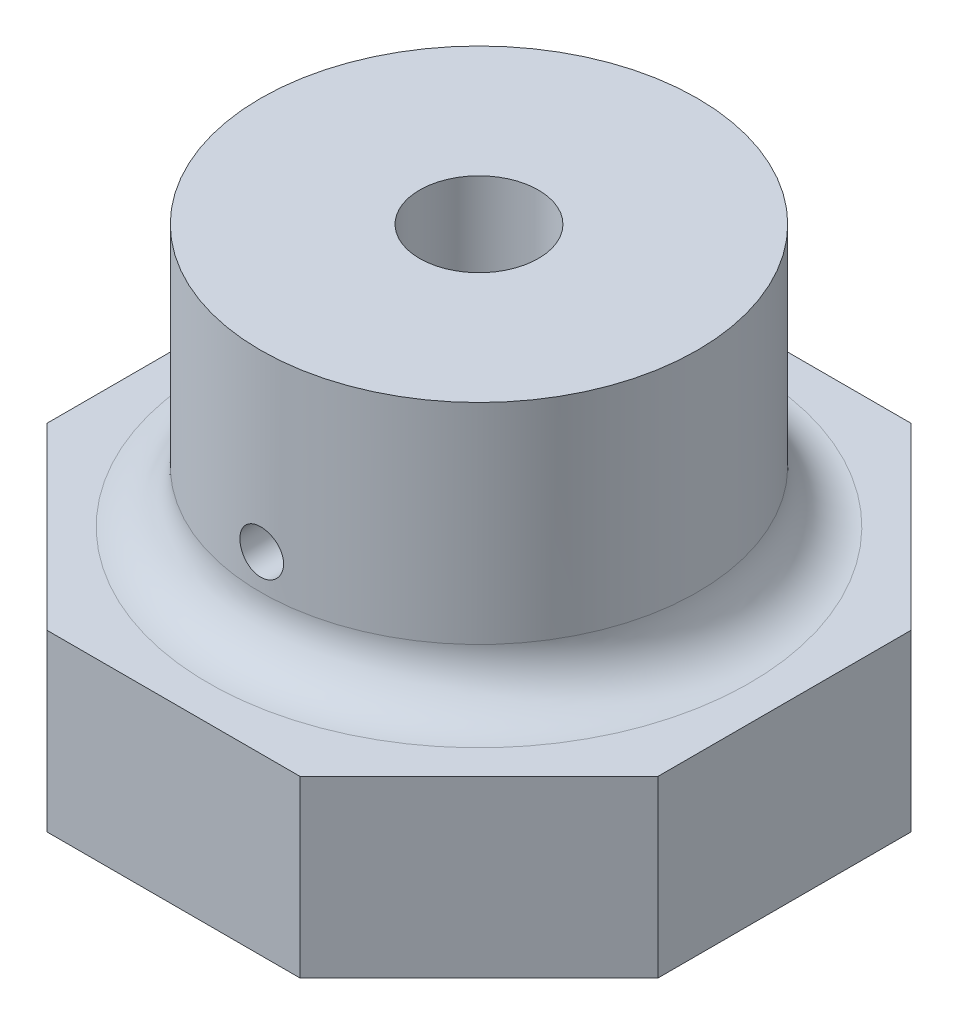
ISO-10303-21;
HEADER;
FILE_DESCRIPTION(('STEP AP214'),'2;1');
FILE_NAME('part.step','',(''),(''),'','','');
FILE_SCHEMA(('AUTOMOTIVE_DESIGN { 1 0 10303 214 1 1 1 1 }'));
ENDSEC;
DATA;
#1=APPLICATION_CONTEXT('core data for automotive mechanical design processes');
#2=APPLICATION_PROTOCOL_DEFINITION('international standard','automotive_design',2000,#1);
#3=PRODUCT_CONTEXT('',#1,'mechanical');
#4=PRODUCT('Part','Part','',(#3));
#5=PRODUCT_RELATED_PRODUCT_CATEGORY('part','',(#4));
#6=PRODUCT_DEFINITION_FORMATION('','',#4);
#7=PRODUCT_DEFINITION_CONTEXT('part definition',#1,'design');
#8=PRODUCT_DEFINITION('design','',#6,#7);
#9=PRODUCT_DEFINITION_SHAPE('','',#8);
#10=(LENGTH_UNIT() NAMED_UNIT(*) SI_UNIT(.MILLI.,.METRE.));
#11=(NAMED_UNIT(*) PLANE_ANGLE_UNIT() SI_UNIT($,.RADIAN.));
#12=(NAMED_UNIT(*) SI_UNIT($,.STERADIAN.) SOLID_ANGLE_UNIT());
#13=UNCERTAINTY_MEASURE_WITH_UNIT(LENGTH_MEASURE(1.E-05),#10,'distance_accuracy_value','');
#14=(GEOMETRIC_REPRESENTATION_CONTEXT(3) GLOBAL_UNCERTAINTY_ASSIGNED_CONTEXT((#13)) GLOBAL_UNIT_ASSIGNED_CONTEXT((#10,
#11,#12)) REPRESENTATION_CONTEXT('',''));
#15=CARTESIAN_POINT('',(0.,0.,0.));
#16=DIRECTION('',(0.,0.,1.));
#17=DIRECTION('',(1.,0.,0.));
#18=AXIS2_PLACEMENT_3D('',#15,#16,#17);
#19=CARTESIAN_POINT('',(0.,25.,0.));
#20=DIRECTION('',(0.,-1.,0.));
#21=DIRECTION('',(0.,0.,-1.));
#22=AXIS2_PLACEMENT_3D('',#19,#20,#21);
#23=CYLINDRICAL_SURFACE('',#22,12.5);
#24=CARTESIAN_POINT('',(0.,13.,0.));
#25=DIRECTION('',(0.,-1.,0.));
#26=DIRECTION('',(0.,0.,-1.));
#27=AXIS2_PLACEMENT_3D('',#24,#25,#26);
#28=CIRCLE('',#27,12.5);
#29=CARTESIAN_POINT('',(0.,13.,-12.5));
#30=VERTEX_POINT('',#29);
#31=EDGE_CURVE('E11',#30,#30,#28,.F.);
#32=ORIENTED_EDGE('',*,*,#31,.T.);
#33=EDGE_LOOP('',(#32));
#34=FACE_BOUND('',#33,.T.);
#35=CARTESIAN_POINT('',(0.,13.75,12.5));
#36=CARTESIAN_POINT('',(0.0700254422394466,13.7500030323755,12.4999991940096));
#37=CARTESIAN_POINT('',(0.140097181459716,13.7559040861206,12.4994053199526));
#38=CARTESIAN_POINT('',(0.278297998121046,13.779355462863,12.4970933449342));
#39=CARTESIAN_POINT('',(0.346424848961035,13.7969186200307,12.4953740054253));
#40=CARTESIAN_POINT('',(0.478714594316768,13.8431778007473,12.4910051820384));
#41=CARTESIAN_POINT('',(0.542879855768636,13.8718671006481,12.4883562600089));
#42=CARTESIAN_POINT('',(0.665470201200507,13.9395511349146,12.4824244674288));
#43=CARTESIAN_POINT('',(0.723896423473845,13.9785438200002,12.4791417229766));
#44=CARTESIAN_POINT('',(0.833574438342602,14.0658783720778,12.4722968042665));
#45=CARTESIAN_POINT('',(0.884802681043615,14.1142497492525,12.4687337696733));
#46=CARTESIAN_POINT('',(0.97842815178873,14.2189056678288,12.4617369613283));
#47=CARTESIAN_POINT('',(1.02082497135332,14.275190575053,12.4583031935615));
#48=CARTESIAN_POINT('',(1.09566746305452,14.3942231646045,12.4519448944098));
#49=CARTESIAN_POINT('',(1.1280918318186,14.4569843051186,12.4490214588863));
#50=CARTESIAN_POINT('',(1.18193298092845,14.5870944823812,12.4440254693316));
#51=CARTESIAN_POINT('',(1.20335003323911,14.6544434057299,12.4419528942778));
#52=CARTESIAN_POINT('',(1.23449880200237,14.7915772510825,12.4389010509122));
#53=CARTESIAN_POINT('',(1.24426956625474,14.8613532210653,12.4379181299762));
#54=CARTESIAN_POINT('',(1.2519691064192,15.0015610792447,12.4371455382566));
#55=CARTESIAN_POINT('',(1.2498981935885,15.0719929501526,12.4373558361093));
#56=CARTESIAN_POINT('',(1.23400535031585,15.2112441371166,12.4389425862367));
#57=CARTESIAN_POINT('',(1.22022605515569,15.2800683741609,12.4403148073831));
#58=CARTESIAN_POINT('',(1.18137393018823,15.4144224540014,12.4440641785927));
#59=CARTESIAN_POINT('',(1.15630094781968,15.4799522522813,12.4464413422311));
#60=CARTESIAN_POINT('',(1.09552611735188,15.6059919841236,12.4519376181509));
#61=CARTESIAN_POINT('',(1.05980535339997,15.6664927368616,12.455058048852));
#62=CARTESIAN_POINT('',(0.978762534191533,15.7806565186399,12.461688146661));
#63=CARTESIAN_POINT('',(0.933440197920632,15.8343193474772,12.4651978251598));
#64=CARTESIAN_POINT('',(0.834242640515087,15.9335317424863,12.4722298164124));
#65=CARTESIAN_POINT('',(0.780330598564205,15.979044502351,12.4757521166625));
#66=CARTESIAN_POINT('',(0.665611852171391,16.060379541138,12.4823978634815));
#67=CARTESIAN_POINT('',(0.604805139999502,16.0962018091956,12.4855213096032));
#68=CARTESIAN_POINT('',(0.477997632115458,16.1571375253878,12.4910184458387));
#69=CARTESIAN_POINT('',(0.41199593298738,16.1822491060226,12.4933920051846));
#70=CARTESIAN_POINT('',(0.276684021662415,16.2210236458897,12.4971205930176));
#71=CARTESIAN_POINT('',(0.207373908470751,16.2346869474883,12.4984756519633));
#72=CARTESIAN_POINT('',(0.0677313738648797,16.2501303846685,12.5000106458539));
#73=CARTESIAN_POINT('',(-0.0025953776318649,16.2519613103156,12.5001956033467));
#74=CARTESIAN_POINT('',(-0.142554741644625,16.243821421189,12.49938302196));
#75=CARTESIAN_POINT('',(-0.212187363525588,16.2338507658559,12.4983854990559));
#76=CARTESIAN_POINT('',(-0.348635258543343,16.202432880723,12.4953232692399));
#77=CARTESIAN_POINT('',(-0.415456061215023,16.1810094319025,12.4932607739755));
#78=CARTESIAN_POINT('',(-0.544555401729726,16.1273185324534,12.4882999857576));
#79=CARTESIAN_POINT('',(-0.606833837696396,16.0950508387008,12.4854016740657));
#80=CARTESIAN_POINT('',(-0.725310225215178,16.0204614516701,12.4790809416303));
#81=CARTESIAN_POINT('',(-0.781487074686146,15.9781063888427,12.475656795043));
#82=CARTESIAN_POINT('',(-0.885952029139847,15.8845924153238,12.468674160869));
#83=CARTESIAN_POINT('',(-0.934239936061471,15.8334332836621,12.4651156699121));
#84=CARTESIAN_POINT('',(-1.02173263735893,15.7235417816762,12.4582503017594));
#85=CARTESIAN_POINT('',(-1.06090409834943,15.6647828043217,12.4549443767372));
#86=CARTESIAN_POINT('',(-1.12882282342978,15.5414907998166,12.4489729057611));
#87=CARTESIAN_POINT('',(-1.15757023006735,15.4769578516395,12.4463073510505));
#88=CARTESIAN_POINT('',(-1.20376901085559,15.3440640756678,12.4419243454256));
#89=CARTESIAN_POINT('',(-1.22124021851483,15.2757101998861,12.4402052306224));
#90=CARTESIAN_POINT('',(-1.24445500891183,15.137021002549,12.437904566036));
#91=CARTESIAN_POINT('',(-1.2501989279994,15.0666857378804,12.4373229836273));
#92=CARTESIAN_POINT('',(-1.24979142308907,14.9263616395541,12.4373639138445));
#93=CARTESIAN_POINT('',(-1.24369236199139,14.8563726463965,12.4379811260876));
#94=CARTESIAN_POINT('',(-1.21988181620457,14.7184188535396,12.4403387986193));
#95=CARTESIAN_POINT('',(-1.2021703184527,14.6504540561175,12.4420792601715));
#96=CARTESIAN_POINT('',(-1.15565210787188,14.5184783136902,12.4464858532898));
#97=CARTESIAN_POINT('',(-1.12684693042614,14.4544668229628,12.4491518567545));
#98=CARTESIAN_POINT('',(-1.0589644436388,14.3321788854112,12.455109397992));
#99=CARTESIAN_POINT('',(-1.01988719181927,14.2739024064742,12.4584009322619));
#100=CARTESIAN_POINT('',(-0.932373195356664,14.1644704069101,12.4652560901212));
#101=CARTESIAN_POINT('',(-0.883897436112835,14.1133461545411,12.4688208090844));
#102=CARTESIAN_POINT('',(-0.779039624031386,14.0199347091254,12.4758106841098));
#103=CARTESIAN_POINT('',(-0.722655680135321,13.9776496358035,12.4792358065372));
#104=CARTESIAN_POINT('',(-0.603426792701611,13.9030331826817,12.4855695258645));
#105=CARTESIAN_POINT('',(-0.540565936683454,13.8707271363185,12.4884768003352));
#106=CARTESIAN_POINT('',(-0.410322848875688,13.8171719714702,12.4934328656237));
#107=CARTESIAN_POINT('',(-0.342945812282012,13.7959103863081,12.4954826238707));
#108=CARTESIAN_POINT('',(-0.229322826757131,13.770349228644,12.4979776721717));
#109=CARTESIAN_POINT('',(-0.183803191055637,13.7627286946258,12.4987325086479));
#110=CARTESIAN_POINT('',(-0.0921957260216416,13.7525530924228,12.4997439368848));
#111=CARTESIAN_POINT('',(-0.0461078990331975,13.7499980033477,12.5000005307003));
#112=CARTESIAN_POINT('',(0.,13.75,12.5));
#113=B_SPLINE_CURVE_WITH_KNOTS('',3,(#35,#36,#37,#38,#39,#40,#41,#42,#43,#44,#45,#46,#47,#48,
#49,#50,#51,#52,#53,#54,#55,#56,#57,#58,#59,#60,#61,#62,#63,#64,#65,#66,#67,#68,#69,#70,#71,#72,
#73,#74,#75,#76,#77,#78,#79,#80,#81,#82,#83,#84,#85,#86,#87,#88,#89,#90,#91,#92,#93,#94,#95,#96,
#97,#98,#99,#100,#101,#102,#103,#104,#105,#106,#107,#108,#109,#110,#111,#112),.UNSPECIFIED.,.T.,
.F.,(4,2,2,2,2,2,2,2,2,2,2,2,2,2,2,2,2,2,2,2,2,2,2,2,2,2,2,2,2,2,2,2,2,2,2,2,2,2,4),(0.,
0.209907957835592,0.420047303544358,0.630059857165252,0.840030671978478,1.05067321077868,
1.26132549025882,1.47242469340277,1.6835186805313,1.89390290056496,2.10428159069721,
2.31389746801388,2.52351617702042,2.73350951716119,2.94350900413907,3.15443417745258,
3.36535958724714,3.57632175866977,3.78727762094299,3.99732735759697,4.20737425648929,
4.41698669117881,4.62660382561833,4.83692425935873,5.04724997262787,5.25833304510748,
5.46941323094217,5.68012113241254,5.89082299049482,6.10059536617445,6.3103679778255,
6.520111567035,6.729853981737,6.94048646784566,7.15116940796197,7.36238288782803,
7.57335743494118,7.71157084040435,7.84978367586284),.UNSPECIFIED.);
#114=CARTESIAN_POINT('',(0.,13.75,12.5));
#115=VERTEX_POINT('',#114);
#116=EDGE_CURVE('E166',#115,#115,#113,.T.);
#117=ORIENTED_EDGE('',*,*,#116,.F.);
#118=EDGE_LOOP('',(#117));
#119=FACE_BOUND('',#118,.T.);
#120=CARTESIAN_POINT('',(0.,25.,0.));
#121=DIRECTION('',(0.,1.,0.));
#122=DIRECTION('',(0.,0.,1.));
#123=AXIS2_PLACEMENT_3D('',#120,#121,#122);
#124=CIRCLE('',#123,12.5);
#125=CARTESIAN_POINT('',(0.,25.,12.5));
#126=VERTEX_POINT('',#125);
#127=EDGE_CURVE('E197',#126,#126,#124,.T.);
#128=ORIENTED_EDGE('',*,*,#127,.F.);
#129=EDGE_LOOP('',(#128));
#130=FACE_BOUND('',#129,.T.);
#131=ADVANCED_FACE('F33',(#34,#119,#130),#23,.T.);
#132=CARTESIAN_POINT('',(0.,-5.,0.));
#133=DIRECTION('',(0.,1.,0.));
#134=DIRECTION('',(0.,0.,1.));
#135=AXIS2_PLACEMENT_3D('',#132,#133,#134);
#136=CYLINDRICAL_SURFACE('',#135,3.4);
#137=CARTESIAN_POINT('',(0.,13.75,3.4));
#138=CARTESIAN_POINT('',(-0.0677892171607673,13.7499980170119,3.40000146331654));
#139=CARTESIAN_POINT('',(-0.135564598361934,13.7555318387459,3.39795478455394));
#140=CARTESIAN_POINT('',(-0.26909502855135,13.7774354118605,3.38999413885064));
#141=CARTESIAN_POINT('',(-0.334850280169572,13.7938040727101,3.38408056111566));
#142=CARTESIAN_POINT('',(-0.462395745289847,13.8367236694127,3.36902233821897));
#143=CARTESIAN_POINT('',(-0.52419316940682,13.863255435735,3.3598837785199));
#144=CARTESIAN_POINT('',(-0.642456858558572,13.9256525911258,3.33928988061704));
#145=CARTESIAN_POINT('',(-0.698921749443891,13.9615203771133,3.32783394762203));
#146=CARTESIAN_POINT('',(-0.807236062786028,14.0431113036963,3.30326648127006));
#147=CARTESIAN_POINT('',(-0.858837279397979,14.0891500983692,3.29010936165044));
#148=CARTESIAN_POINT('',(-0.953784546892117,14.1891059845685,3.26385143452452));
#149=CARTESIAN_POINT('',(-0.997128211461575,14.2430253455331,3.25075064436247));
#150=CARTESIAN_POINT('',(-1.07587794830608,14.3596015519421,3.22556373470524));
#151=CARTESIAN_POINT('',(-1.1109385995811,14.4225045942777,3.21353174119785));
#152=CARTESIAN_POINT('',(-1.169873285278,14.5538269292873,3.1925510826781));
#153=CARTESIAN_POINT('',(-1.19375159057167,14.6222441042281,3.18360124084615));
#154=CARTESIAN_POINT('',(-1.22867274772655,14.7598006640153,3.17028423169877));
#155=CARTESIAN_POINT('',(-1.240187857077,14.8288033629552,3.16574912315888));
#156=CARTESIAN_POINT('',(-1.25153246307679,14.9678991963207,3.16128255395447));
#157=CARTESIAN_POINT('',(-1.25136654827011,15.037991891756,3.16134928559326));
#158=CARTESIAN_POINT('',(-1.23971593690306,15.1730139586237,3.16593361273821));
#159=CARTESIAN_POINT('',(-1.22887882487036,15.2380094389009,3.17019655489708));
#160=CARTESIAN_POINT('',(-1.19726140059541,15.3651850627672,3.1822709670128));
#161=CARTESIAN_POINT('',(-1.17647964980696,15.4273647976184,3.19008295034953));
#162=CARTESIAN_POINT('',(-1.12519507437492,15.5484912223078,3.20853358348492));
#163=CARTESIAN_POINT('',(-1.09451999071546,15.6073571090671,3.21922172021088));
#164=CARTESIAN_POINT('',(-1.02443943999763,15.7192969276157,3.24220311718025));
#165=CARTESIAN_POINT('',(-0.985031042794176,15.772368906529,3.2544969155751));
#166=CARTESIAN_POINT('',(-0.895612788060466,15.8748094687074,3.2802706130014));
#167=CARTESIAN_POINT('',(-0.845083649862122,15.9237194686581,3.2937759110097));
#168=CARTESIAN_POINT('',(-0.736382513755413,16.0125048916467,3.31976812924212));
#169=CARTESIAN_POINT('',(-0.678209432538006,16.0523790319249,3.33225490471266));
#170=CARTESIAN_POINT('',(-0.5547386381725,16.1224405003473,3.35503450804791));
#171=CARTESIAN_POINT('',(-0.489350681704928,16.1524806435267,3.36529328894331));
#172=CARTESIAN_POINT('',(-0.353978761405023,16.2009839206669,3.3822096165739));
#173=CARTESIAN_POINT('',(-0.283996770412044,16.2194519886152,3.38886869794702));
#174=CARTESIAN_POINT('',(-0.145287056221838,16.2434180981954,3.39756841138687));
#175=CARTESIAN_POINT('',(-0.0766797713938729,16.2495340410432,3.39982885071684));
#176=CARTESIAN_POINT('',(0.0606097533059029,16.2504143095227,3.40015216072335));
#177=CARTESIAN_POINT('',(0.129291974246831,16.2451810367229,3.39821591944508));
#178=CARTESIAN_POINT('',(0.262148070171438,16.2239849677789,3.39050858407269));
#179=CARTESIAN_POINT('',(0.326394930340766,16.2084222303544,3.38488056379091));
#180=CARTESIAN_POINT('',(0.451324217395486,16.1675308263642,3.37049899094654));
#181=CARTESIAN_POINT('',(0.512006179294813,16.1422008890625,3.36174503170277));
#182=CARTESIAN_POINT('',(0.630048307528177,16.0816955074235,3.34166563948511));
#183=CARTESIAN_POINT('',(0.687261597391693,16.0462564452485,3.33027314354124));
#184=CARTESIAN_POINT('',(0.795117514625444,15.9668387265093,3.30618315270462));
#185=CARTESIAN_POINT('',(0.845757774063343,15.9228570066208,3.29348519045388));
#186=CARTESIAN_POINT('',(0.941978948201328,15.8247159245322,3.26730782187835));
#187=CARTESIAN_POINT('',(0.987120742437628,15.7701260198728,3.25382429649654));
#188=CARTESIAN_POINT('',(1.06768370658743,15.6538749198076,3.22828791150846));
#189=CARTESIAN_POINT('',(1.10310417920205,15.5922132175997,3.21623515456468));
#190=CARTESIAN_POINT('',(1.16321017780084,15.4631631413808,3.19499088071639));
#191=CARTESIAN_POINT('',(1.18786541999424,15.3957592415927,3.18580745591354));
#192=CARTESIAN_POINT('',(1.22532296166541,15.2573271556384,3.17159152678578));
#193=CARTESIAN_POINT('',(1.23813220871965,15.1863011196508,3.16655658959702));
#194=CARTESIAN_POINT('',(1.25092657125444,15.0473781049194,3.16152264427503));
#195=CARTESIAN_POINT('',(1.25165673096916,14.9795597381631,3.16123108212347));
#196=CARTESIAN_POINT('',(1.24216724879889,14.8448214754842,3.16497172509223));
#197=CARTESIAN_POINT('',(1.23194856404745,14.777901501543,3.16900355226758));
#198=CARTESIAN_POINT('',(1.20142269472295,14.6487681271679,3.18069761158729));
#199=CARTESIAN_POINT('',(1.18140795745555,14.5864752340908,3.18825432323419));
#200=CARTESIAN_POINT('',(1.13211148856821,14.4660925656169,3.20608909678897));
#201=CARTESIAN_POINT('',(1.10282745899068,14.40800383687,3.21636783341288));
#202=CARTESIAN_POINT('',(1.03409142755035,14.2944644508441,3.23913993166123));
#203=CARTESIAN_POINT('',(0.994197606283686,14.239298733656,3.25171941003279));
#204=CARTESIAN_POINT('',(0.906069647255589,14.1362061550017,3.2773681497848));
#205=CARTESIAN_POINT('',(0.857832911872158,14.0882815568397,3.29043756271399));
#206=CARTESIAN_POINT('',(0.751434346562938,13.9985350564082,3.31639721388888));
#207=CARTESIAN_POINT('',(0.69289085032639,13.9571511358243,3.32924403256629));
#208=CARTESIAN_POINT('',(0.569232189993616,13.8848299969958,3.35260043067959));
#209=CARTESIAN_POINT('',(0.504116943366298,13.8538929099685,3.36310998075766));
#210=CARTESIAN_POINT('',(0.367269046892198,13.8028849461682,3.38082725111374));
#211=CARTESIAN_POINT('',(0.295405373622671,13.7831292938135,3.38793838162925));
#212=CARTESIAN_POINT('',(0.149021417621224,13.7566908687623,3.39752290246279));
#213=CARTESIAN_POINT('',(0.0745023528183592,13.7500021793625,3.39999839177188));
#214=CARTESIAN_POINT('',(0.,13.75,3.4));
#215=B_SPLINE_CURVE_WITH_KNOTS('',3,(#137,#138,#139,#140,#141,#142,#143,#144,#145,#146,#147,
#148,#149,#150,#151,#152,#153,#154,#155,#156,#157,#158,#159,#160,#161,#162,#163,#164,#165,#166,
#167,#168,#169,#170,#171,#172,#173,#174,#175,#176,#177,#178,#179,#180,#181,#182,#183,#184,#185,
#186,#187,#188,#189,#190,#191,#192,#193,#194,#195,#196,#197,#198,#199,#200,#201,#202,#203,#204,
#205,#206,#207,#208,#209,#210,#211,#212,#213,#214),.UNSPECIFIED.,.T.,.F.,(4,2,2,2,2,2,2,2,2,2,2,
2,2,2,2,2,2,2,2,2,2,2,2,2,2,2,2,2,2,2,2,2,2,2,2,2,2,2,4),(0.,0.203092960313766,
0.406165482344126,0.608856842569649,0.81160029295984,1.0218483188273,1.2321570114653,
1.45010318970421,1.66796605976637,1.87717331404362,2.08629838791308,2.28346874972133,
2.48066764192297,2.68150439920305,2.88240864223019,3.09625066160904,3.31012301969535,
3.52706381874591,3.74391205766217,3.94961363586606,4.15527169051426,4.35339622228795,
4.55154653923887,4.75542903938099,4.95938478547858,5.17470475574975,5.3900401666332,
5.60597749729216,5.82178810205814,6.02423406709817,6.2266623360228,6.42338544370823,
6.62015735942234,6.82694877089592,7.03380468454549,7.25124959552094,7.46869723761042,
7.69200353860394,7.91520870334772),.UNSPECIFIED.);
#216=CARTESIAN_POINT('',(0.,13.75,3.4));
#217=VERTEX_POINT('',#216);
#218=EDGE_CURVE('E156',#217,#217,#215,.T.);
#219=ORIENTED_EDGE('',*,*,#218,.F.);
#220=EDGE_LOOP('',(#219));
#221=FACE_BOUND('',#220,.T.);
#222=CARTESIAN_POINT('',(0.,25.,0.));
#223=DIRECTION('',(0.,1.,0.));
#224=DIRECTION('',(0.,0.,1.));
#225=AXIS2_PLACEMENT_3D('',#222,#223,#224);
#226=CIRCLE('',#225,3.4);
#227=CARTESIAN_POINT('',(0.,25.,3.4));
#228=VERTEX_POINT('',#227);
#229=EDGE_CURVE('E173',#228,#228,#226,.T.);
#230=ORIENTED_EDGE('',*,*,#229,.T.);
#231=EDGE_LOOP('',(#230));
#232=FACE_BOUND('',#231,.T.);
#233=CARTESIAN_POINT('',(0.,10.,0.));
#234=DIRECTION('',(0.,-1.,0.));
#235=DIRECTION('',(0.,0.,-1.));
#236=AXIS2_PLACEMENT_3D('',#233,#234,#235);
#237=CIRCLE('',#236,3.4);
#238=CARTESIAN_POINT('',(0.,10.,-3.4));
#239=VERTEX_POINT('',#238);
#240=EDGE_CURVE('E198',#239,#239,#237,.F.);
#241=ORIENTED_EDGE('',*,*,#240,.F.);
#242=EDGE_LOOP('',(#241));
#243=FACE_BOUND('',#242,.T.);
#244=ADVANCED_FACE('F187',(#221,#232,#243),#136,.F.);
#245=CARTESIAN_POINT('',(0.,25.,0.));
#246=DIRECTION('',(0.,1.,0.));
#247=DIRECTION('',(0.,0.,1.));
#248=AXIS2_PLACEMENT_3D('',#245,#246,#247);
#249=PLANE('',#248);
#250=ORIENTED_EDGE('',*,*,#229,.F.);
#251=EDGE_LOOP('',(#250));
#252=FACE_BOUND('',#251,.T.);
#253=ORIENTED_EDGE('',*,*,#127,.T.);
#254=EDGE_LOOP('',(#253));
#255=FACE_BOUND('',#254,.T.);
#256=ADVANCED_FACE('F183',(#252,#255),#249,.T.);
#257=CARTESIAN_POINT('',(0.,15.,12.5));
#258=DIRECTION('',(0.,0.,-1.));
#259=DIRECTION('',(-1.,0.,0.));
#260=AXIS2_PLACEMENT_3D('',#257,#258,#259);
#261=CYLINDRICAL_SURFACE('',#260,1.25);
#262=ORIENTED_EDGE('',*,*,#218,.T.);
#263=EDGE_LOOP('',(#262));
#264=FACE_BOUND('',#263,.T.);
#265=ORIENTED_EDGE('',*,*,#116,.T.);
#266=EDGE_LOOP('',(#265));
#267=FACE_BOUND('',#266,.T.);
#268=ADVANCED_FACE('F177',(#264,#267),#261,.F.);
#269=CARTESIAN_POINT('',(0.,10.,0.));
#270=DIRECTION('',(0.,-1.,0.));
#271=DIRECTION('',(0.,0.,-1.));
#272=AXIS2_PLACEMENT_3D('',#269,#270,#271);
#273=PLANE('',#272);
#274=ORIENTED_EDGE('',*,*,#240,.T.);
#275=EDGE_LOOP('',(#274));
#276=FACE_BOUND('',#275,.T.);
#277=ADVANCED_FACE('F182',(#276),#273,.F.);
#278=CARTESIAN_POINT('',(0.,10.,0.));
#279=DIRECTION('',(0.,-1.,0.));
#280=DIRECTION('',(0.,0.,-1.));
#281=AXIS2_PLACEMENT_3D('',#278,#279,#280);
#282=CIRCLE('',#281,15.5);
#283=CARTESIAN_POINT('',(0.,10.,-15.5));
#284=VERTEX_POINT('',#283);
#285=EDGE_CURVE('E42',#284,#284,#282,.T.);
#286=ORIENTED_EDGE('',*,*,#285,.T.);
#287=EDGE_LOOP('',(#286));
#288=FACE_BOUND('',#287,.T.);
#289=DIRECTION('',(0.,0.,1.));
#290=VECTOR('',#289,1.);
#291=CARTESIAN_POINT('',(17.5,10.,-7.24873734152917));
#292=LINE('',#291,#290);
#293=CARTESIAN_POINT('',(17.5,10.,-7.24873734152917));
#294=VERTEX_POINT('',#293);
#295=CARTESIAN_POINT('',(17.5,10.,7.24873734152917));
#296=VERTEX_POINT('',#295);
#297=EDGE_CURVE('E154',#294,#296,#292,.T.);
#298=ORIENTED_EDGE('',*,*,#297,.F.);
#299=DIRECTION('',(0.707106781186547,0.,0.707106781186547));
#300=VECTOR('',#299,1.);
#301=CARTESIAN_POINT('',(7.24873734152917,10.,-17.5));
#302=LINE('',#301,#300);
#303=CARTESIAN_POINT('',(7.24873734152917,10.,-17.5));
#304=VERTEX_POINT('',#303);
#305=EDGE_CURVE('E123',#304,#294,#302,.T.);
#306=ORIENTED_EDGE('',*,*,#305,.F.);
#307=DIRECTION('',(1.,0.,0.));
#308=VECTOR('',#307,1.);
#309=CARTESIAN_POINT('',(-7.24873734152916,10.,-17.5));
#310=LINE('',#309,#308);
#311=CARTESIAN_POINT('',(-7.24873734152916,10.,-17.5));
#312=VERTEX_POINT('',#311);
#313=EDGE_CURVE('E108',#312,#304,#310,.T.);
#314=ORIENTED_EDGE('',*,*,#313,.F.);
#315=DIRECTION('',(0.707106781186548,0.,-0.707106781186547));
#316=VECTOR('',#315,1.);
#317=CARTESIAN_POINT('',(-17.5,10.,-7.24873734152917));
#318=LINE('',#317,#316);
#319=CARTESIAN_POINT('',(-17.5,10.,-7.24873734152917));
#320=VERTEX_POINT('',#319);
#321=EDGE_CURVE('E121',#320,#312,#318,.T.);
#322=ORIENTED_EDGE('',*,*,#321,.F.);
#323=DIRECTION('',(0.,0.,-1.));
#324=VECTOR('',#323,1.);
#325=CARTESIAN_POINT('',(-17.5,10.,7.24873734152916));
#326=LINE('',#325,#324);
#327=CARTESIAN_POINT('',(-17.5,10.,7.24873734152916));
#328=VERTEX_POINT('',#327);
#329=EDGE_CURVE('E126',#328,#320,#326,.T.);
#330=ORIENTED_EDGE('',*,*,#329,.F.);
#331=DIRECTION('',(-0.707106781186547,0.,-0.707106781186548));
#332=VECTOR('',#331,1.);
#333=CARTESIAN_POINT('',(-7.24873734152917,10.,17.5));
#334=LINE('',#333,#332);
#335=CARTESIAN_POINT('',(-7.24873734152917,10.,17.5));
#336=VERTEX_POINT('',#335);
#337=EDGE_CURVE('E128',#336,#328,#334,.T.);
#338=ORIENTED_EDGE('',*,*,#337,.F.);
#339=DIRECTION('',(-1.,0.,0.));
#340=VECTOR('',#339,1.);
#341=CARTESIAN_POINT('',(7.24873734152917,10.,17.5));
#342=LINE('',#341,#340);
#343=CARTESIAN_POINT('',(7.24873734152917,10.,17.5));
#344=VERTEX_POINT('',#343);
#345=EDGE_CURVE('E354',#344,#336,#342,.T.);
#346=ORIENTED_EDGE('',*,*,#345,.F.);
#347=DIRECTION('',(-0.707106781186548,0.,0.707106781186548));
#348=VECTOR('',#347,1.);
#349=CARTESIAN_POINT('',(17.5,10.,7.24873734152917));
#350=LINE('',#349,#348);
#351=EDGE_CURVE('E352',#296,#344,#350,.T.);
#352=ORIENTED_EDGE('',*,*,#351,.F.);
#353=EDGE_LOOP('',(#298,#306,#314,#322,#330,#338,#346,#352));
#354=FACE_BOUND('',#353,.T.);
#355=ADVANCED_FACE('F119',(#288,#354),#273,.F.);
#356=CARTESIAN_POINT('',(17.5,10.,-7.24873734152917));
#357=DIRECTION('',(1.,0.,0.));
#358=DIRECTION('',(0.,0.,-1.));
#359=AXIS2_PLACEMENT_3D('',#356,#357,#358);
#360=PLANE('',#359);
#361=DIRECTION('',(0.,0.,1.));
#362=VECTOR('',#361,1.);
#363=CARTESIAN_POINT('',(17.5,0.,-7.24873734152917));
#364=LINE('',#363,#362);
#365=CARTESIAN_POINT('',(17.5,0.,-7.24873734152917));
#366=VERTEX_POINT('',#365);
#367=CARTESIAN_POINT('',(17.5,0.,7.24873734152917));
#368=VERTEX_POINT('',#367);
#369=EDGE_CURVE('E133',#366,#368,#364,.T.);
#370=ORIENTED_EDGE('',*,*,#369,.F.);
#371=DIRECTION('',(0.,-1.,0.));
#372=VECTOR('',#371,1.);
#373=CARTESIAN_POINT('',(17.5,10.,-7.24873734152917));
#374=LINE('',#373,#372);
#375=EDGE_CURVE('E50',#294,#366,#374,.T.);
#376=ORIENTED_EDGE('',*,*,#375,.F.);
#377=ORIENTED_EDGE('',*,*,#297,.T.);
#378=DIRECTION('',(0.,-1.,0.));
#379=VECTOR('',#378,1.);
#380=CARTESIAN_POINT('',(17.5,10.,7.24873734152917));
#381=LINE('',#380,#379);
#382=EDGE_CURVE('E91',#296,#368,#381,.T.);
#383=ORIENTED_EDGE('',*,*,#382,.T.);
#384=EDGE_LOOP('',(#370,#376,#377,#383));
#385=FACE_BOUND('',#384,.T.);
#386=ADVANCED_FACE('F185',(#385),#360,.T.);
#387=CARTESIAN_POINT('',(7.24873734152917,10.,-17.5));
#388=DIRECTION('',(0.707106781186548,0.,-0.707106781186547));
#389=DIRECTION('',(-0.707106781186547,0.,-0.707106781186548));
#390=AXIS2_PLACEMENT_3D('',#387,#388,#389);
#391=PLANE('',#390);
#392=DIRECTION('',(0.707106781186547,0.,0.707106781186547));
#393=VECTOR('',#392,1.);
#394=CARTESIAN_POINT('',(7.24873734152917,0.,-17.5));
#395=LINE('',#394,#393);
#396=CARTESIAN_POINT('',(7.24873734152917,0.,-17.5));
#397=VERTEX_POINT('',#396);
#398=EDGE_CURVE('E151',#397,#366,#395,.T.);
#399=ORIENTED_EDGE('',*,*,#398,.F.);
#400=DIRECTION('',(0.,-1.,0.));
#401=VECTOR('',#400,1.);
#402=CARTESIAN_POINT('',(7.24873734152917,10.,-17.5));
#403=LINE('',#402,#401);
#404=EDGE_CURVE('E79',#304,#397,#403,.T.);
#405=ORIENTED_EDGE('',*,*,#404,.F.);
#406=ORIENTED_EDGE('',*,*,#305,.T.);
#407=ORIENTED_EDGE('',*,*,#375,.T.);
#408=EDGE_LOOP('',(#399,#405,#406,#407));
#409=FACE_BOUND('',#408,.T.);
#410=ADVANCED_FACE('F257',(#409),#391,.T.);
#411=CARTESIAN_POINT('',(-7.24873734152916,10.,-17.5));
#412=DIRECTION('',(0.,0.,-1.));
#413=DIRECTION('',(-1.,0.,0.));
#414=AXIS2_PLACEMENT_3D('',#411,#412,#413);
#415=PLANE('',#414);
#416=DIRECTION('',(1.,0.,0.));
#417=VECTOR('',#416,1.);
#418=CARTESIAN_POINT('',(-7.24873734152916,0.,-17.5));
#419=LINE('',#418,#417);
#420=CARTESIAN_POINT('',(-7.24873734152916,0.,-17.5));
#421=VERTEX_POINT('',#420);
#422=EDGE_CURVE('E110',#421,#397,#419,.T.);
#423=ORIENTED_EDGE('',*,*,#422,.F.);
#424=DIRECTION('',(0.,-1.,0.));
#425=VECTOR('',#424,1.);
#426=CARTESIAN_POINT('',(-7.24873734152916,10.,-17.5));
#427=LINE('',#426,#425);
#428=EDGE_CURVE('E105',#312,#421,#427,.T.);
#429=ORIENTED_EDGE('',*,*,#428,.F.);
#430=ORIENTED_EDGE('',*,*,#313,.T.);
#431=ORIENTED_EDGE('',*,*,#404,.T.);
#432=EDGE_LOOP('',(#423,#429,#430,#431));
#433=FACE_BOUND('',#432,.T.);
#434=ADVANCED_FACE('F107',(#433),#415,.T.);
#435=CARTESIAN_POINT('',(-17.5,10.,-7.24873734152917));
#436=DIRECTION('',(-0.707106781186547,0.,-0.707106781186548));
#437=DIRECTION('',(-0.707106781186548,0.,0.707106781186547));
#438=AXIS2_PLACEMENT_3D('',#435,#436,#437);
#439=PLANE('',#438);
#440=DIRECTION('',(0.707106781186548,0.,-0.707106781186547));
#441=VECTOR('',#440,1.);
#442=CARTESIAN_POINT('',(-17.5,0.,-7.24873734152917));
#443=LINE('',#442,#441);
#444=CARTESIAN_POINT('',(-17.5,0.,-7.24873734152917));
#445=VERTEX_POINT('',#444);
#446=EDGE_CURVE('E148',#445,#421,#443,.T.);
#447=ORIENTED_EDGE('',*,*,#446,.F.);
#448=DIRECTION('',(0.,-1.,0.));
#449=VECTOR('',#448,1.);
#450=CARTESIAN_POINT('',(-17.5,10.,-7.24873734152917));
#451=LINE('',#450,#449);
#452=EDGE_CURVE('E115',#320,#445,#451,.T.);
#453=ORIENTED_EDGE('',*,*,#452,.F.);
#454=ORIENTED_EDGE('',*,*,#321,.T.);
#455=ORIENTED_EDGE('',*,*,#428,.T.);
#456=EDGE_LOOP('',(#447,#453,#454,#455));
#457=FACE_BOUND('',#456,.T.);
#458=ADVANCED_FACE('F125',(#457),#439,.T.);
#459=CARTESIAN_POINT('',(-17.5,10.,7.24873734152916));
#460=DIRECTION('',(-1.,0.,0.));
#461=DIRECTION('',(0.,0.,1.));
#462=AXIS2_PLACEMENT_3D('',#459,#460,#461);
#463=PLANE('',#462);
#464=DIRECTION('',(0.,0.,-1.));
#465=VECTOR('',#464,1.);
#466=CARTESIAN_POINT('',(-17.5,0.,7.24873734152916));
#467=LINE('',#466,#465);
#468=CARTESIAN_POINT('',(-17.5,0.,7.24873734152916));
#469=VERTEX_POINT('',#468);
#470=EDGE_CURVE('E145',#469,#445,#467,.T.);
#471=ORIENTED_EDGE('',*,*,#470,.F.);
#472=DIRECTION('',(0.,-1.,0.));
#473=VECTOR('',#472,1.);
#474=CARTESIAN_POINT('',(-17.5,10.,7.24873734152916));
#475=LINE('',#474,#473);
#476=EDGE_CURVE('E159',#328,#469,#475,.T.);
#477=ORIENTED_EDGE('',*,*,#476,.F.);
#478=ORIENTED_EDGE('',*,*,#329,.T.);
#479=ORIENTED_EDGE('',*,*,#452,.T.);
#480=EDGE_LOOP('',(#471,#477,#478,#479));
#481=FACE_BOUND('',#480,.T.);
#482=ADVANCED_FACE('F275',(#481),#463,.T.);
#483=CARTESIAN_POINT('',(-7.24873734152917,10.,17.5));
#484=DIRECTION('',(-0.707106781186548,0.,0.707106781186547));
#485=DIRECTION('',(0.707106781186547,0.,0.707106781186548));
#486=AXIS2_PLACEMENT_3D('',#483,#484,#485);
#487=PLANE('',#486);
#488=DIRECTION('',(-0.707106781186547,0.,-0.707106781186548));
#489=VECTOR('',#488,1.);
#490=CARTESIAN_POINT('',(-7.24873734152917,0.,17.5));
#491=LINE('',#490,#489);
#492=CARTESIAN_POINT('',(-7.24873734152917,0.,17.5));
#493=VERTEX_POINT('',#492);
#494=EDGE_CURVE('E142',#493,#469,#491,.T.);
#495=ORIENTED_EDGE('',*,*,#494,.F.);
#496=DIRECTION('',(0.,-1.,0.));
#497=VECTOR('',#496,1.);
#498=CARTESIAN_POINT('',(-7.24873734152917,10.,17.5));
#499=LINE('',#498,#497);
#500=EDGE_CURVE('E161',#336,#493,#499,.T.);
#501=ORIENTED_EDGE('',*,*,#500,.F.);
#502=ORIENTED_EDGE('',*,*,#337,.T.);
#503=ORIENTED_EDGE('',*,*,#476,.T.);
#504=EDGE_LOOP('',(#495,#501,#502,#503));
#505=FACE_BOUND('',#504,.T.);
#506=ADVANCED_FACE('F282',(#505),#487,.T.);
#507=CARTESIAN_POINT('',(7.24873734152917,10.,17.5));
#508=DIRECTION('',(0.,0.,1.));
#509=DIRECTION('',(1.,0.,0.));
#510=AXIS2_PLACEMENT_3D('',#507,#508,#509);
#511=PLANE('',#510);
#512=DIRECTION('',(-1.,0.,0.));
#513=VECTOR('',#512,1.);
#514=CARTESIAN_POINT('',(7.24873734152917,0.,17.5));
#515=LINE('',#514,#513);
#516=CARTESIAN_POINT('',(7.24873734152917,0.,17.5));
#517=VERTEX_POINT('',#516);
#518=EDGE_CURVE('E139',#517,#493,#515,.T.);
#519=ORIENTED_EDGE('',*,*,#518,.F.);
#520=DIRECTION('',(0.,-1.,0.));
#521=VECTOR('',#520,1.);
#522=CARTESIAN_POINT('',(7.24873734152917,10.,17.5));
#523=LINE('',#522,#521);
#524=EDGE_CURVE('E163',#344,#517,#523,.T.);
#525=ORIENTED_EDGE('',*,*,#524,.F.);
#526=ORIENTED_EDGE('',*,*,#345,.T.);
#527=ORIENTED_EDGE('',*,*,#500,.T.);
#528=EDGE_LOOP('',(#519,#525,#526,#527));
#529=FACE_BOUND('',#528,.T.);
#530=ADVANCED_FACE('F290',(#529),#511,.T.);
#531=CARTESIAN_POINT('',(17.5,10.,7.24873734152917));
#532=DIRECTION('',(0.707106781186548,0.,0.707106781186548));
#533=DIRECTION('',(0.707106781186548,0.,-0.707106781186548));
#534=AXIS2_PLACEMENT_3D('',#531,#532,#533);
#535=PLANE('',#534);
#536=DIRECTION('',(-0.707106781186548,0.,0.707106781186548));
#537=VECTOR('',#536,1.);
#538=CARTESIAN_POINT('',(17.5,0.,7.24873734152917));
#539=LINE('',#538,#537);
#540=EDGE_CURVE('E136',#368,#517,#539,.T.);
#541=ORIENTED_EDGE('',*,*,#540,.F.);
#542=ORIENTED_EDGE('',*,*,#382,.F.);
#543=ORIENTED_EDGE('',*,*,#351,.T.);
#544=ORIENTED_EDGE('',*,*,#524,.T.);
#545=EDGE_LOOP('',(#541,#542,#543,#544));
#546=FACE_BOUND('',#545,.T.);
#547=ADVANCED_FACE('F210',(#546),#535,.T.);
#548=CARTESIAN_POINT('',(0.,0.,0.));
#549=DIRECTION('',(0.,1.,0.));
#550=DIRECTION('',(0.,0.,1.));
#551=AXIS2_PLACEMENT_3D('',#548,#549,#550);
#552=PLANE('',#551);
#553=ORIENTED_EDGE('',*,*,#369,.T.);
#554=ORIENTED_EDGE('',*,*,#540,.T.);
#555=ORIENTED_EDGE('',*,*,#518,.T.);
#556=ORIENTED_EDGE('',*,*,#494,.T.);
#557=ORIENTED_EDGE('',*,*,#470,.T.);
#558=ORIENTED_EDGE('',*,*,#446,.T.);
#559=ORIENTED_EDGE('',*,*,#422,.T.);
#560=ORIENTED_EDGE('',*,*,#398,.T.);
#561=EDGE_LOOP('',(#553,#554,#555,#556,#557,#558,#559,#560));
#562=FACE_BOUND('',#561,.T.);
#563=ADVANCED_FACE('F205',(#562),#552,.F.);
#564=CARTESIAN_POINT('',(0.,13.,0.));
#565=DIRECTION('',(0.,-1.,0.));
#566=DIRECTION('',(0.,0.,-1.));
#567=AXIS2_PLACEMENT_3D('',#564,#565,#566);
#568=TOROIDAL_SURFACE('',#567,15.5,3.);
#569=ORIENTED_EDGE('',*,*,#31,.F.);
#570=EDGE_LOOP('',(#569));
#571=FACE_BOUND('',#570,.T.);
#572=ORIENTED_EDGE('',*,*,#285,.F.);
#573=EDGE_LOOP('',(#572));
#574=FACE_BOUND('',#573,.T.);
#575=ADVANCED_FACE('F35',(#571,#574),#568,.F.);
#576=CLOSED_SHELL('',(#131,#244,#256,#268,#277,#355,#386,#410,#434,#458,#482,#506,#530,#547,
#563,#575));
#577=MANIFOLD_SOLID_BREP('B2',#576);
#578=ADVANCED_BREP_SHAPE_REPRESENTATION('',(#18,#577),#14);
#579=SHAPE_DEFINITION_REPRESENTATION(#9,#578);
ENDSEC;
END-ISO-10303-21;
